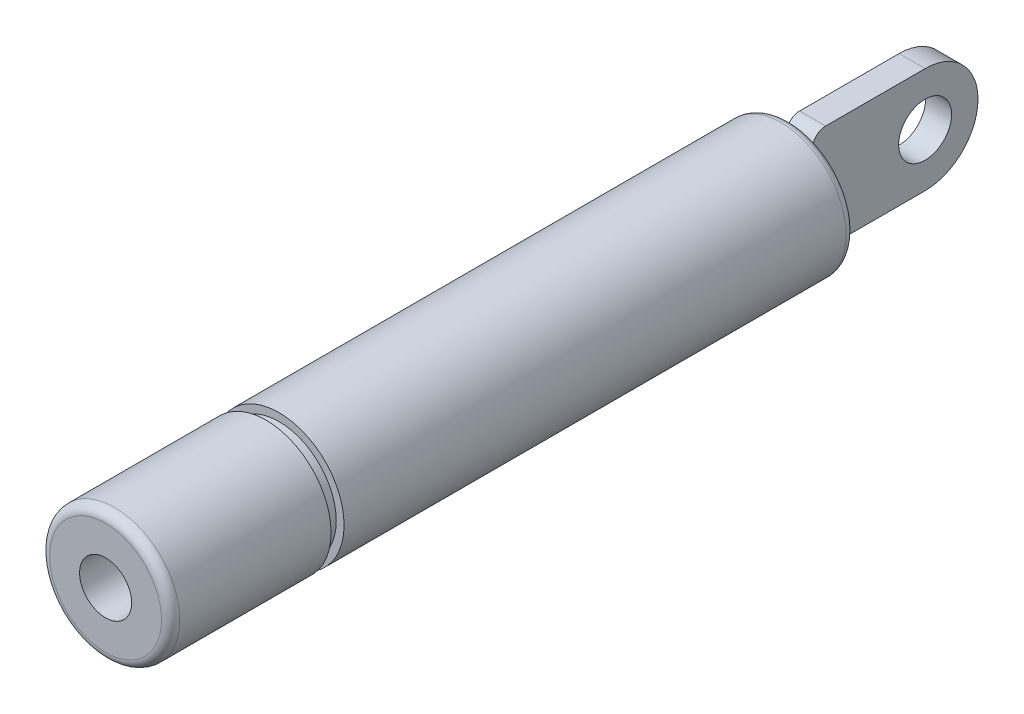
ISO-10303-21;
HEADER;
FILE_DESCRIPTION(('STEP AP214'),'2;1');
FILE_NAME('part.step','',(''),(''),'','','');
FILE_SCHEMA(('AUTOMOTIVE_DESIGN { 1 0 10303 214 1 1 1 1 }'));
ENDSEC;
DATA;
#1=APPLICATION_CONTEXT('core data for automotive mechanical design processes');
#2=APPLICATION_PROTOCOL_DEFINITION('international standard','automotive_design',2000,#1);
#3=PRODUCT_CONTEXT('',#1,'mechanical');
#4=PRODUCT('Part','Part','',(#3));
#5=PRODUCT_RELATED_PRODUCT_CATEGORY('part','',(#4));
#6=PRODUCT_DEFINITION_FORMATION('','',#4);
#7=PRODUCT_DEFINITION_CONTEXT('part definition',#1,'design');
#8=PRODUCT_DEFINITION('design','',#6,#7);
#9=PRODUCT_DEFINITION_SHAPE('','',#8);
#10=(LENGTH_UNIT() NAMED_UNIT(*) SI_UNIT(.MILLI.,.METRE.));
#11=(NAMED_UNIT(*) PLANE_ANGLE_UNIT() SI_UNIT($,.RADIAN.));
#12=(NAMED_UNIT(*) SI_UNIT($,.STERADIAN.) SOLID_ANGLE_UNIT());
#13=UNCERTAINTY_MEASURE_WITH_UNIT(LENGTH_MEASURE(1.E-05),#10,'distance_accuracy_value','');
#14=(GEOMETRIC_REPRESENTATION_CONTEXT(3) GLOBAL_UNCERTAINTY_ASSIGNED_CONTEXT((#13)) GLOBAL_UNIT_ASSIGNED_CONTEXT((#10,
#11,#12)) REPRESENTATION_CONTEXT('',''));
#15=CARTESIAN_POINT('',(0.,0.,0.));
#16=DIRECTION('',(0.,0.,1.));
#17=DIRECTION('',(1.,0.,0.));
#18=AXIS2_PLACEMENT_3D('',#15,#16,#17);
#19=CARTESIAN_POINT('',(0.,0.,-80.));
#20=DIRECTION('',(0.,0.,1.));
#21=DIRECTION('',(0.,-1.,0.));
#22=AXIS2_PLACEMENT_3D('',#19,#20,#21);
#23=SPHERICAL_SURFACE('',#22,3.);
#24=CARTESIAN_POINT('',(-1.5,0.,-80.));
#25=DIRECTION('',(1.,0.,0.));
#26=DIRECTION('',(0.,0.,-1.));
#27=AXIS2_PLACEMENT_3D('',#24,#25,#26);
#28=CIRCLE('',#27,2.59807621135332);
#29=CARTESIAN_POINT('',(-1.5,-2.59807621135332,-80.));
#30=VERTEX_POINT('',#29);
#31=CARTESIAN_POINT('',(-1.5,2.59807621135332,-80.));
#32=VERTEX_POINT('',#31);
#33=EDGE_CURVE('E179',#30,#32,#28,.T.);
#34=ORIENTED_EDGE('',*,*,#33,.F.);
#35=CARTESIAN_POINT('',(0.,0.,-80.));
#36=DIRECTION('',(0.,0.,1.));
#37=DIRECTION('',(1.,0.,0.));
#38=AXIS2_PLACEMENT_3D('',#35,#36,#37);
#39=CIRCLE('',#38,3.);
#40=EDGE_CURVE('E11',#32,#30,#39,.T.);
#41=ORIENTED_EDGE('',*,*,#40,.F.);
#42=EDGE_LOOP('',(#34,#41));
#43=FACE_BOUND('',#42,.T.);
#44=ADVANCED_FACE('F16',(#43),#23,.T.);
#45=CARTESIAN_POINT('',(0.,3.9,-80.));
#46=DIRECTION('',(0.,0.,-1.));
#47=DIRECTION('',(-1.,0.,0.));
#48=AXIS2_PLACEMENT_3D('',#45,#46,#47);
#49=PLANE('',#48);
#50=CARTESIAN_POINT('',(0.,0.,-80.));
#51=DIRECTION('',(0.,0.,1.));
#52=DIRECTION('',(1.,0.,0.));
#53=AXIS2_PLACEMENT_3D('',#50,#51,#52);
#54=CIRCLE('',#53,3.9);
#55=CARTESIAN_POINT('',(-1.5,3.6,-80.));
#56=VERTEX_POINT('',#55);
#57=CARTESIAN_POINT('',(-1.5,-3.60000000000022,-80.));
#58=VERTEX_POINT('',#57);
#59=EDGE_CURVE('E254',#56,#58,#54,.T.);
#60=ORIENTED_EDGE('',*,*,#59,.F.);
#61=DIRECTION('',(0.,1.,0.));
#62=VECTOR('',#61,1.);
#63=CARTESIAN_POINT('',(-1.5,-4.575,-80.));
#64=LINE('',#63,#62);
#65=EDGE_CURVE('E131',#32,#56,#64,.T.);
#66=ORIENTED_EDGE('',*,*,#65,.F.);
#67=ORIENTED_EDGE('',*,*,#40,.T.);
#68=EDGE_CURVE('E121',#58,#30,#64,.T.);
#69=ORIENTED_EDGE('',*,*,#68,.F.);
#70=EDGE_LOOP('',(#60,#66,#67,#69));
#71=FACE_BOUND('',#70,.T.);
#72=ADVANCED_FACE('F298',(#71),#49,.T.);
#73=CARTESIAN_POINT('',(0.,0.,-65.5));
#74=DIRECTION('',(0.,0.,-1.));
#75=DIRECTION('',(-1.,0.,0.));
#76=AXIS2_PLACEMENT_3D('',#73,#74,#75);
#77=PLANE('',#76);
#78=CARTESIAN_POINT('',(0.,0.,-65.5));
#79=DIRECTION('',(0.,0.,1.));
#80=DIRECTION('',(0.,-1.,0.));
#81=AXIS2_PLACEMENT_3D('',#78,#79,#80);
#82=CIRCLE('',#81,6.);
#83=CARTESIAN_POINT('',(0.,-6.,-65.5));
#84=VERTEX_POINT('',#83);
#85=EDGE_CURVE('E208',#84,#84,#82,.T.);
#86=ORIENTED_EDGE('',*,*,#85,.T.);
#87=EDGE_LOOP('',(#86));
#88=FACE_BOUND('',#87,.T.);
#89=ADVANCED_FACE('F303',(#88),#77,.F.);
#90=CARTESIAN_POINT('',(0.,0.,-21.5));
#91=DIRECTION('',(0.,0.,1.));
#92=DIRECTION('',(1.,0.,0.));
#93=AXIS2_PLACEMENT_3D('',#90,#91,#92);
#94=PLANE('',#93);
#95=CARTESIAN_POINT('',(0.,0.,-21.5));
#96=DIRECTION('',(0.,0.,1.));
#97=DIRECTION('',(1.,0.,0.));
#98=AXIS2_PLACEMENT_3D('',#95,#96,#97);
#99=CIRCLE('',#98,3.);
#100=CARTESIAN_POINT('',(3.,0.,-21.5));
#101=VERTEX_POINT('',#100);
#102=EDGE_CURVE('E20',#101,#101,#99,.T.);
#103=ORIENTED_EDGE('',*,*,#102,.T.);
#104=EDGE_LOOP('',(#103));
#105=FACE_BOUND('',#104,.T.);
#106=CARTESIAN_POINT('',(0.,0.,-21.5));
#107=DIRECTION('',(0.,0.,-1.));
#108=DIRECTION('',(0.,-1.,0.));
#109=AXIS2_PLACEMENT_3D('',#106,#107,#108);
#110=CIRCLE('',#109,6.);
#111=CARTESIAN_POINT('',(0.,-6.,-21.5));
#112=VERTEX_POINT('',#111);
#113=EDGE_CURVE('E204',#112,#112,#110,.T.);
#114=ORIENTED_EDGE('',*,*,#113,.T.);
#115=EDGE_LOOP('',(#114));
#116=FACE_BOUND('',#115,.T.);
#117=ADVANCED_FACE('F319',(#105,#116),#94,.F.);
#118=CARTESIAN_POINT('',(0.,0.,-21.5));
#119=DIRECTION('',(0.,0.,-1.));
#120=DIRECTION('',(0.,-1.,0.));
#121=AXIS2_PLACEMENT_3D('',#118,#119,#120);
#122=CYLINDRICAL_SURFACE('',#121,6.);
#123=ORIENTED_EDGE('',*,*,#85,.F.);
#124=EDGE_LOOP('',(#123));
#125=FACE_BOUND('',#124,.T.);
#126=ORIENTED_EDGE('',*,*,#113,.F.);
#127=EDGE_LOOP('',(#126));
#128=FACE_BOUND('',#127,.T.);
#129=ADVANCED_FACE('F313',(#125,#128),#122,.F.);
#130=CARTESIAN_POINT('',(0.,0.,1.));
#131=DIRECTION('',(0.,0.,-1.));
#132=DIRECTION('',(0.,-1.,0.));
#133=AXIS2_PLACEMENT_3D('',#130,#131,#132);
#134=CYLINDRICAL_SURFACE('',#133,3.);
#135=CARTESIAN_POINT('',(0.,0.,0.));
#136=DIRECTION('',(0.,0.,1.));
#137=DIRECTION('',(1.,0.,0.));
#138=AXIS2_PLACEMENT_3D('',#135,#136,#137);
#139=CIRCLE('',#138,3.);
#140=CARTESIAN_POINT('',(3.,0.,0.));
#141=VERTEX_POINT('',#140);
#142=EDGE_CURVE('E200',#141,#141,#139,.T.);
#143=ORIENTED_EDGE('',*,*,#142,.T.);
#144=EDGE_LOOP('',(#143));
#145=FACE_BOUND('',#144,.T.);
#146=ORIENTED_EDGE('',*,*,#102,.F.);
#147=EDGE_LOOP('',(#146));
#148=FACE_BOUND('',#147,.T.);
#149=ADVANCED_FACE('F307',(#145,#148),#134,.F.);
#150=CARTESIAN_POINT('',(1.5,-2.59807621135332,-80.));
#151=VERTEX_POINT('',#150);
#152=CARTESIAN_POINT('',(1.5,2.59807621135332,-80.));
#153=VERTEX_POINT('',#152);
#154=EDGE_CURVE('E26',#151,#153,#39,.T.);
#155=ORIENTED_EDGE('',*,*,#154,.F.);
#156=CARTESIAN_POINT('',(1.5,0.,-80.));
#157=DIRECTION('',(1.,0.,0.));
#158=DIRECTION('',(0.,0.,-1.));
#159=AXIS2_PLACEMENT_3D('',#156,#157,#158);
#160=CIRCLE('',#159,2.59807621135332);
#161=EDGE_CURVE('E196',#151,#153,#160,.T.);
#162=ORIENTED_EDGE('',*,*,#161,.T.);
#163=EDGE_LOOP('',(#155,#162));
#164=FACE_BOUND('',#163,.T.);
#165=ADVANCED_FACE('F18',(#164),#23,.T.);
#166=DIRECTION('',(0.,1.,0.));
#167=VECTOR('',#166,1.);
#168=CARTESIAN_POINT('',(1.5,-4.575,-80.));
#169=LINE('',#168,#167);
#170=CARTESIAN_POINT('',(1.5,3.6,-80.));
#171=VERTEX_POINT('',#170);
#172=EDGE_CURVE('E265',#153,#171,#169,.T.);
#173=ORIENTED_EDGE('',*,*,#172,.T.);
#174=CARTESIAN_POINT('',(1.5,-3.6,-80.));
#175=VERTEX_POINT('',#174);
#176=EDGE_CURVE('E252',#175,#171,#54,.T.);
#177=ORIENTED_EDGE('',*,*,#176,.F.);
#178=EDGE_CURVE('E161',#175,#151,#169,.T.);
#179=ORIENTED_EDGE('',*,*,#178,.T.);
#180=ORIENTED_EDGE('',*,*,#154,.T.);
#181=EDGE_LOOP('',(#173,#177,#179,#180));
#182=FACE_BOUND('',#181,.T.);
#183=ADVANCED_FACE('F263',(#182),#49,.T.);
#184=CARTESIAN_POINT('',(0.,0.,-79.1));
#185=DIRECTION('',(0.,0.,1.));
#186=DIRECTION('',(1.,0.,0.));
#187=AXIS2_PLACEMENT_3D('',#184,#185,#186);
#188=TOROIDAL_SURFACE('',#187,3.9,0.9);
#189=CARTESIAN_POINT('',(0.,0.,-79.1));
#190=DIRECTION('',(0.,0.,1.));
#191=DIRECTION('',(1.,0.,0.));
#192=AXIS2_PLACEMENT_3D('',#189,#190,#191);
#193=CIRCLE('',#192,4.8);
#194=CARTESIAN_POINT('',(4.80000000000001,0.,-79.1));
#195=VERTEX_POINT('',#194);
#196=EDGE_CURVE('E248',#195,#195,#193,.T.);
#197=ORIENTED_EDGE('',*,*,#196,.F.);
#198=EDGE_LOOP('',(#197));
#199=FACE_BOUND('',#198,.T.);
#200=EDGE_CURVE('E41',#171,#56,#54,.T.);
#201=ORIENTED_EDGE('',*,*,#200,.T.);
#202=ORIENTED_EDGE('',*,*,#59,.T.);
#203=EDGE_CURVE('E119',#58,#175,#54,.T.);
#204=ORIENTED_EDGE('',*,*,#203,.T.);
#205=ORIENTED_EDGE('',*,*,#176,.T.);
#206=EDGE_LOOP('',(#201,#202,#204,#205));
#207=FACE_BOUND('',#206,.T.);
#208=ADVANCED_FACE('F312',(#199,#207),#188,.T.);
#209=CARTESIAN_POINT('',(0.,0.,0.));
#210=DIRECTION('',(0.,0.,1.));
#211=DIRECTION('',(1.,0.,0.));
#212=AXIS2_PLACEMENT_3D('',#209,#210,#211);
#213=CYLINDRICAL_SURFACE('',#212,4.8);
#214=ORIENTED_EDGE('',*,*,#196,.T.);
#215=EDGE_LOOP('',(#214));
#216=FACE_BOUND('',#215,.T.);
#217=CARTESIAN_POINT('',(0.,0.,-78.95));
#218=DIRECTION('',(0.,0.,1.));
#219=DIRECTION('',(1.,0.,0.));
#220=AXIS2_PLACEMENT_3D('',#217,#218,#219);
#221=CIRCLE('',#220,4.8);
#222=CARTESIAN_POINT('',(4.80000000000001,0.,-78.95));
#223=VERTEX_POINT('',#222);
#224=EDGE_CURVE('E244',#223,#223,#221,.T.);
#225=ORIENTED_EDGE('',*,*,#224,.F.);
#226=EDGE_LOOP('',(#225));
#227=FACE_BOUND('',#226,.T.);
#228=ADVANCED_FACE('F367',(#216,#227),#213,.T.);
#229=CARTESIAN_POINT('',(0.,6.45,-78.95));
#230=DIRECTION('',(0.,0.,-1.));
#231=DIRECTION('',(-1.,0.,0.));
#232=AXIS2_PLACEMENT_3D('',#229,#230,#231);
#233=PLANE('',#232);
#234=ORIENTED_EDGE('',*,*,#224,.T.);
#235=EDGE_LOOP('',(#234));
#236=FACE_BOUND('',#235,.T.);
#237=CARTESIAN_POINT('',(0.,0.,-78.95));
#238=DIRECTION('',(0.,0.,1.));
#239=DIRECTION('',(1.,0.,0.));
#240=AXIS2_PLACEMENT_3D('',#237,#238,#239);
#241=CIRCLE('',#240,6.45);
#242=CARTESIAN_POINT('',(6.45000000000001,0.,-78.95));
#243=VERTEX_POINT('',#242);
#244=EDGE_CURVE('E240',#243,#243,#241,.T.);
#245=ORIENTED_EDGE('',*,*,#244,.F.);
#246=EDGE_LOOP('',(#245));
#247=FACE_BOUND('',#246,.T.);
#248=ADVANCED_FACE('F363',(#236,#247),#233,.T.);
#249=CARTESIAN_POINT('',(0.,0.,-77.9));
#250=DIRECTION('',(0.,0.,1.));
#251=DIRECTION('',(1.,0.,0.));
#252=AXIS2_PLACEMENT_3D('',#249,#250,#251);
#253=TOROIDAL_SURFACE('',#252,6.45,1.05);
#254=CARTESIAN_POINT('',(0.,0.,-77.9));
#255=DIRECTION('',(0.,0.,1.));
#256=DIRECTION('',(1.,0.,0.));
#257=AXIS2_PLACEMENT_3D('',#254,#255,#256);
#258=CIRCLE('',#257,7.5);
#259=CARTESIAN_POINT('',(7.5,0.,-77.9));
#260=VERTEX_POINT('',#259);
#261=EDGE_CURVE('E236',#260,#260,#258,.T.);
#262=ORIENTED_EDGE('',*,*,#261,.F.);
#263=EDGE_LOOP('',(#262));
#264=FACE_BOUND('',#263,.T.);
#265=ORIENTED_EDGE('',*,*,#244,.T.);
#266=EDGE_LOOP('',(#265));
#267=FACE_BOUND('',#266,.T.);
#268=ADVANCED_FACE('F359',(#264,#267),#253,.T.);
#269=CARTESIAN_POINT('',(0.,0.,0.));
#270=DIRECTION('',(0.,0.,1.));
#271=DIRECTION('',(1.,0.,0.));
#272=AXIS2_PLACEMENT_3D('',#269,#270,#271);
#273=CYLINDRICAL_SURFACE('',#272,7.5);
#274=ORIENTED_EDGE('',*,*,#261,.T.);
#275=EDGE_LOOP('',(#274));
#276=FACE_BOUND('',#275,.T.);
#277=CARTESIAN_POINT('',(0.,0.,-20.));
#278=DIRECTION('',(0.,0.,1.));
#279=DIRECTION('',(1.,0.,0.));
#280=AXIS2_PLACEMENT_3D('',#277,#278,#279);
#281=CIRCLE('',#280,7.5);
#282=CARTESIAN_POINT('',(7.5,0.,-20.));
#283=VERTEX_POINT('',#282);
#284=EDGE_CURVE('E232',#283,#283,#281,.T.);
#285=ORIENTED_EDGE('',*,*,#284,.F.);
#286=EDGE_LOOP('',(#285));
#287=FACE_BOUND('',#286,.T.);
#288=ADVANCED_FACE('F355',(#276,#287),#273,.T.);
#289=CARTESIAN_POINT('',(0.,6.6,-20.));
#290=DIRECTION('',(0.,0.,1.));
#291=DIRECTION('',(1.,0.,0.));
#292=AXIS2_PLACEMENT_3D('',#289,#290,#291);
#293=PLANE('',#292);
#294=ORIENTED_EDGE('',*,*,#284,.T.);
#295=EDGE_LOOP('',(#294));
#296=FACE_BOUND('',#295,.T.);
#297=CARTESIAN_POINT('',(0.,0.,-20.));
#298=DIRECTION('',(0.,0.,1.));
#299=DIRECTION('',(1.,0.,0.));
#300=AXIS2_PLACEMENT_3D('',#297,#298,#299);
#301=CIRCLE('',#300,6.6);
#302=CARTESIAN_POINT('',(6.6,0.,-20.));
#303=VERTEX_POINT('',#302);
#304=EDGE_CURVE('E228',#303,#303,#301,.T.);
#305=ORIENTED_EDGE('',*,*,#304,.F.);
#306=EDGE_LOOP('',(#305));
#307=FACE_BOUND('',#306,.T.);
#308=ADVANCED_FACE('F351',(#296,#307),#293,.T.);
#309=CARTESIAN_POINT('',(0.,0.,0.));
#310=DIRECTION('',(0.,0.,1.));
#311=DIRECTION('',(1.,0.,0.));
#312=AXIS2_PLACEMENT_3D('',#309,#310,#311);
#313=CYLINDRICAL_SURFACE('',#312,6.6);
#314=ORIENTED_EDGE('',*,*,#304,.T.);
#315=EDGE_LOOP('',(#314));
#316=FACE_BOUND('',#315,.T.);
#317=CARTESIAN_POINT('',(0.,0.,-18.5));
#318=DIRECTION('',(0.,0.,1.));
#319=DIRECTION('',(1.,0.,0.));
#320=AXIS2_PLACEMENT_3D('',#317,#318,#319);
#321=CIRCLE('',#320,6.6);
#322=CARTESIAN_POINT('',(6.6,0.,-18.5));
#323=VERTEX_POINT('',#322);
#324=EDGE_CURVE('E224',#323,#323,#321,.T.);
#325=ORIENTED_EDGE('',*,*,#324,.F.);
#326=EDGE_LOOP('',(#325));
#327=FACE_BOUND('',#326,.T.);
#328=ADVANCED_FACE('F347',(#316,#327),#313,.T.);
#329=CARTESIAN_POINT('',(0.,7.5,-18.5));
#330=DIRECTION('',(0.,0.,-1.));
#331=DIRECTION('',(-1.,0.,0.));
#332=AXIS2_PLACEMENT_3D('',#329,#330,#331);
#333=PLANE('',#332);
#334=ORIENTED_EDGE('',*,*,#324,.T.);
#335=EDGE_LOOP('',(#334));
#336=FACE_BOUND('',#335,.T.);
#337=CARTESIAN_POINT('',(0.,0.,-18.5));
#338=DIRECTION('',(0.,0.,1.));
#339=DIRECTION('',(1.,0.,0.));
#340=AXIS2_PLACEMENT_3D('',#337,#338,#339);
#341=CIRCLE('',#340,7.5);
#342=CARTESIAN_POINT('',(7.5,0.,-18.5));
#343=VERTEX_POINT('',#342);
#344=EDGE_CURVE('E220',#343,#343,#341,.T.);
#345=ORIENTED_EDGE('',*,*,#344,.F.);
#346=EDGE_LOOP('',(#345));
#347=FACE_BOUND('',#346,.T.);
#348=ADVANCED_FACE('F343',(#336,#347),#333,.T.);
#349=CARTESIAN_POINT('',(0.,0.,0.));
#350=DIRECTION('',(0.,0.,1.));
#351=DIRECTION('',(1.,0.,0.));
#352=AXIS2_PLACEMENT_3D('',#349,#350,#351);
#353=CYLINDRICAL_SURFACE('',#352,7.5);
#354=ORIENTED_EDGE('',*,*,#344,.T.);
#355=EDGE_LOOP('',(#354));
#356=FACE_BOUND('',#355,.T.);
#357=CARTESIAN_POINT('',(0.,0.,-1.05));
#358=DIRECTION('',(0.,0.,1.));
#359=DIRECTION('',(1.,0.,0.));
#360=AXIS2_PLACEMENT_3D('',#357,#358,#359);
#361=CIRCLE('',#360,7.5);
#362=CARTESIAN_POINT('',(7.5,0.,-1.05));
#363=VERTEX_POINT('',#362);
#364=EDGE_CURVE('E216',#363,#363,#361,.T.);
#365=ORIENTED_EDGE('',*,*,#364,.F.);
#366=EDGE_LOOP('',(#365));
#367=FACE_BOUND('',#366,.T.);
#368=ADVANCED_FACE('F339',(#356,#367),#353,.T.);
#369=CARTESIAN_POINT('',(0.,0.,-1.05));
#370=DIRECTION('',(0.,0.,1.));
#371=DIRECTION('',(1.,0.,0.));
#372=AXIS2_PLACEMENT_3D('',#369,#370,#371);
#373=TOROIDAL_SURFACE('',#372,6.45,1.05);
#374=CARTESIAN_POINT('',(0.,0.,0.));
#375=DIRECTION('',(0.,0.,1.));
#376=DIRECTION('',(1.,0.,0.));
#377=AXIS2_PLACEMENT_3D('',#374,#375,#376);
#378=CIRCLE('',#377,6.45);
#379=CARTESIAN_POINT('',(6.45,0.,0.));
#380=VERTEX_POINT('',#379);
#381=EDGE_CURVE('E212',#380,#380,#378,.T.);
#382=ORIENTED_EDGE('',*,*,#381,.F.);
#383=EDGE_LOOP('',(#382));
#384=FACE_BOUND('',#383,.T.);
#385=ORIENTED_EDGE('',*,*,#364,.T.);
#386=EDGE_LOOP('',(#385));
#387=FACE_BOUND('',#386,.T.);
#388=ADVANCED_FACE('F335',(#384,#387),#373,.T.);
#389=CARTESIAN_POINT('',(0.,0.,0.));
#390=DIRECTION('',(0.,0.,1.));
#391=DIRECTION('',(1.,0.,0.));
#392=AXIS2_PLACEMENT_3D('',#389,#390,#391);
#393=PLANE('',#392);
#394=ORIENTED_EDGE('',*,*,#142,.F.);
#395=EDGE_LOOP('',(#394));
#396=FACE_BOUND('',#395,.T.);
#397=ORIENTED_EDGE('',*,*,#381,.T.);
#398=EDGE_LOOP('',(#397));
#399=FACE_BOUND('',#398,.T.);
#400=ADVANCED_FACE('F332',(#396,#399),#393,.T.);
#401=CARTESIAN_POINT('',(1.5,-4.575,-80.));
#402=DIRECTION('',(0.,0.,1.));
#403=DIRECTION('',(0.,-1.,0.));
#404=AXIS2_PLACEMENT_3D('',#401,#402,#403);
#405=PLANE('',#404);
#406=ORIENTED_EDGE('',*,*,#200,.F.);
#407=CARTESIAN_POINT('',(1.5,4.575,-80.));
#408=VERTEX_POINT('',#407);
#409=EDGE_CURVE('E162',#171,#408,#169,.T.);
#410=ORIENTED_EDGE('',*,*,#409,.T.);
#411=DIRECTION('',(-1.,0.,0.));
#412=VECTOR('',#411,1.);
#413=CARTESIAN_POINT('',(1.5,4.575,-80.));
#414=LINE('',#413,#412);
#415=CARTESIAN_POINT('',(-1.5,4.575,-80.));
#416=VERTEX_POINT('',#415);
#417=EDGE_CURVE('E104',#408,#416,#414,.T.);
#418=ORIENTED_EDGE('',*,*,#417,.T.);
#419=EDGE_CURVE('E123',#56,#416,#64,.T.);
#420=ORIENTED_EDGE('',*,*,#419,.F.);
#421=EDGE_LOOP('',(#406,#410,#418,#420));
#422=FACE_BOUND('',#421,.T.);
#423=ADVANCED_FACE('F278',(#422),#405,.T.);
#424=ORIENTED_EDGE('',*,*,#203,.F.);
#425=CARTESIAN_POINT('',(-1.5,-4.575,-80.));
#426=VERTEX_POINT('',#425);
#427=EDGE_CURVE('E109',#426,#58,#64,.T.);
#428=ORIENTED_EDGE('',*,*,#427,.F.);
#429=DIRECTION('',(-1.,0.,0.));
#430=VECTOR('',#429,1.);
#431=CARTESIAN_POINT('',(1.5,-4.575,-80.));
#432=LINE('',#431,#430);
#433=CARTESIAN_POINT('',(1.5,-4.575,-80.));
#434=VERTEX_POINT('',#433);
#435=EDGE_CURVE('E95',#434,#426,#432,.T.);
#436=ORIENTED_EDGE('',*,*,#435,.F.);
#437=EDGE_CURVE('E33',#434,#175,#169,.T.);
#438=ORIENTED_EDGE('',*,*,#437,.T.);
#439=EDGE_LOOP('',(#424,#428,#436,#438));
#440=FACE_BOUND('',#439,.T.);
#441=ADVANCED_FACE('F117',(#440),#405,.T.);
#442=CARTESIAN_POINT('',(1.5,-4.575,-81.525));
#443=DIRECTION('',(1.,0.,0.));
#444=DIRECTION('',(0.,0.,-1.));
#445=AXIS2_PLACEMENT_3D('',#442,#443,#444);
#446=PLANE('',#445);
#447=CARTESIAN_POINT('',(1.5,0.,-93.));
#448=DIRECTION('',(1.,0.,0.));
#449=DIRECTION('',(0.,0.,-1.));
#450=AXIS2_PLACEMENT_3D('',#447,#448,#449);
#451=CIRCLE('',#450,3.05);
#452=CARTESIAN_POINT('',(1.5,0.,-96.05));
#453=VERTEX_POINT('',#452);
#454=EDGE_CURVE('E115',#453,#453,#451,.T.);
#455=ORIENTED_EDGE('',*,*,#454,.F.);
#456=EDGE_LOOP('',(#455));
#457=FACE_BOUND('',#456,.T.);
#458=ORIENTED_EDGE('',*,*,#161,.F.);
#459=ORIENTED_EDGE('',*,*,#178,.F.);
#460=ORIENTED_EDGE('',*,*,#437,.F.);
#461=CARTESIAN_POINT('',(1.5,-4.575,-81.525));
#462=DIRECTION('',(1.,0.,0.));
#463=DIRECTION('',(0.,0.,-1.));
#464=AXIS2_PLACEMENT_3D('',#461,#462,#463);
#465=CIRCLE('',#464,1.525);
#466=CARTESIAN_POINT('',(1.5,-6.1,-81.525));
#467=VERTEX_POINT('',#466);
#468=EDGE_CURVE('E101',#434,#467,#465,.T.);
#469=ORIENTED_EDGE('',*,*,#468,.T.);
#470=DIRECTION('',(0.,0.,-1.));
#471=VECTOR('',#470,1.);
#472=CARTESIAN_POINT('',(1.5,-6.1,-81.525));
#473=LINE('',#472,#471);
#474=CARTESIAN_POINT('',(1.5,-6.1,-93.));
#475=VERTEX_POINT('',#474);
#476=EDGE_CURVE('E128',#467,#475,#473,.T.);
#477=ORIENTED_EDGE('',*,*,#476,.T.);
#478=CARTESIAN_POINT('',(1.5,0.,-93.));
#479=DIRECTION('',(1.,0.,0.));
#480=DIRECTION('',(0.,0.,-1.));
#481=AXIS2_PLACEMENT_3D('',#478,#479,#480);
#482=CIRCLE('',#481,6.1);
#483=CARTESIAN_POINT('',(1.5,6.1,-93.));
#484=VERTEX_POINT('',#483);
#485=EDGE_CURVE('E171',#475,#484,#482,.T.);
#486=ORIENTED_EDGE('',*,*,#485,.T.);
#487=DIRECTION('',(0.,0.,-1.));
#488=VECTOR('',#487,1.);
#489=CARTESIAN_POINT('',(1.5,6.1,-81.525));
#490=LINE('',#489,#488);
#491=CARTESIAN_POINT('',(1.5,6.1,-81.525));
#492=VERTEX_POINT('',#491);
#493=EDGE_CURVE('E167',#492,#484,#490,.T.);
#494=ORIENTED_EDGE('',*,*,#493,.F.);
#495=CARTESIAN_POINT('',(1.5,4.575,-81.525));
#496=DIRECTION('',(1.,0.,0.));
#497=DIRECTION('',(0.,0.,-1.));
#498=AXIS2_PLACEMENT_3D('',#495,#496,#497);
#499=CIRCLE('',#498,1.525);
#500=EDGE_CURVE('E163',#492,#408,#499,.T.);
#501=ORIENTED_EDGE('',*,*,#500,.T.);
#502=ORIENTED_EDGE('',*,*,#409,.F.);
#503=ORIENTED_EDGE('',*,*,#172,.F.);
#504=EDGE_LOOP('',(#458,#459,#460,#469,#477,#486,#494,#501,#502,#503));
#505=FACE_BOUND('',#504,.T.);
#506=ADVANCED_FACE('F269',(#457,#505),#446,.T.);
#507=CARTESIAN_POINT('',(-1.5,-4.575,-81.525));
#508=DIRECTION('',(1.,0.,0.));
#509=DIRECTION('',(0.,0.,-1.));
#510=AXIS2_PLACEMENT_3D('',#507,#508,#509);
#511=PLANE('',#510);
#512=CARTESIAN_POINT('',(-1.5,0.,-93.));
#513=DIRECTION('',(1.,0.,0.));
#514=DIRECTION('',(0.,0.,-1.));
#515=AXIS2_PLACEMENT_3D('',#512,#513,#514);
#516=CIRCLE('',#515,3.05);
#517=CARTESIAN_POINT('',(-1.5,0.,-96.05));
#518=VERTEX_POINT('',#517);
#519=EDGE_CURVE('E191',#518,#518,#516,.T.);
#520=ORIENTED_EDGE('',*,*,#519,.T.);
#521=EDGE_LOOP('',(#520));
#522=FACE_BOUND('',#521,.T.);
#523=ORIENTED_EDGE('',*,*,#68,.T.);
#524=ORIENTED_EDGE('',*,*,#33,.T.);
#525=ORIENTED_EDGE('',*,*,#65,.T.);
#526=ORIENTED_EDGE('',*,*,#419,.T.);
#527=CARTESIAN_POINT('',(-1.5,4.575,-81.525));
#528=DIRECTION('',(1.,0.,0.));
#529=DIRECTION('',(0.,0.,-1.));
#530=AXIS2_PLACEMENT_3D('',#527,#528,#529);
#531=CIRCLE('',#530,1.525);
#532=CARTESIAN_POINT('',(-1.5,6.1,-81.525));
#533=VERTEX_POINT('',#532);
#534=EDGE_CURVE('E135',#533,#416,#531,.T.);
#535=ORIENTED_EDGE('',*,*,#534,.F.);
#536=DIRECTION('',(0.,0.,-1.));
#537=VECTOR('',#536,1.);
#538=CARTESIAN_POINT('',(-1.5,6.1,-81.525));
#539=LINE('',#538,#537);
#540=CARTESIAN_POINT('',(-1.5,6.1,-93.));
#541=VERTEX_POINT('',#540);
#542=EDGE_CURVE('E144',#533,#541,#539,.T.);
#543=ORIENTED_EDGE('',*,*,#542,.T.);
#544=CARTESIAN_POINT('',(-1.5,0.,-93.));
#545=DIRECTION('',(1.,0.,0.));
#546=DIRECTION('',(0.,0.,-1.));
#547=AXIS2_PLACEMENT_3D('',#544,#545,#546);
#548=CIRCLE('',#547,6.1);
#549=CARTESIAN_POINT('',(-1.5,-6.1,-93.));
#550=VERTEX_POINT('',#549);
#551=EDGE_CURVE('E151',#550,#541,#548,.T.);
#552=ORIENTED_EDGE('',*,*,#551,.F.);
#553=DIRECTION('',(0.,0.,-1.));
#554=VECTOR('',#553,1.);
#555=CARTESIAN_POINT('',(-1.5,-6.1,-81.525));
#556=LINE('',#555,#554);
#557=CARTESIAN_POINT('',(-1.5,-6.1,-81.525));
#558=VERTEX_POINT('',#557);
#559=EDGE_CURVE('E112',#558,#550,#556,.T.);
#560=ORIENTED_EDGE('',*,*,#559,.F.);
#561=CARTESIAN_POINT('',(-1.5,-4.575,-81.525));
#562=DIRECTION('',(1.,0.,0.));
#563=DIRECTION('',(0.,0.,-1.));
#564=AXIS2_PLACEMENT_3D('',#561,#562,#563);
#565=CIRCLE('',#564,1.525);
#566=EDGE_CURVE('E99',#426,#558,#565,.T.);
#567=ORIENTED_EDGE('',*,*,#566,.F.);
#568=ORIENTED_EDGE('',*,*,#427,.T.);
#569=EDGE_LOOP('',(#523,#524,#525,#526,#535,#543,#552,#560,#567,#568));
#570=FACE_BOUND('',#569,.T.);
#571=ADVANCED_FACE('F108',(#522,#570),#511,.F.);
#572=CARTESIAN_POINT('',(1.5,-4.575,-81.525));
#573=DIRECTION('',(-1.,0.,0.));
#574=DIRECTION('',(0.,0.,1.));
#575=AXIS2_PLACEMENT_3D('',#572,#573,#574);
#576=CYLINDRICAL_SURFACE('',#575,1.525);
#577=ORIENTED_EDGE('',*,*,#566,.T.);
#578=DIRECTION('',(-1.,0.,0.));
#579=VECTOR('',#578,1.);
#580=CARTESIAN_POINT('',(1.5,-6.1,-81.525));
#581=LINE('',#580,#579);
#582=EDGE_CURVE('E176',#467,#558,#581,.T.);
#583=ORIENTED_EDGE('',*,*,#582,.F.);
#584=ORIENTED_EDGE('',*,*,#468,.F.);
#585=ORIENTED_EDGE('',*,*,#435,.T.);
#586=EDGE_LOOP('',(#577,#583,#584,#585));
#587=FACE_BOUND('',#586,.T.);
#588=ADVANCED_FACE('F97',(#587),#576,.T.);
#589=CARTESIAN_POINT('',(1.5,-6.1,-81.525));
#590=DIRECTION('',(0.,1.,0.));
#591=DIRECTION('',(0.,0.,1.));
#592=AXIS2_PLACEMENT_3D('',#589,#590,#591);
#593=PLANE('',#592);
#594=ORIENTED_EDGE('',*,*,#559,.T.);
#595=DIRECTION('',(-1.,0.,0.));
#596=VECTOR('',#595,1.);
#597=CARTESIAN_POINT('',(1.5,-6.1,-93.));
#598=LINE('',#597,#596);
#599=EDGE_CURVE('E180',#475,#550,#598,.T.);
#600=ORIENTED_EDGE('',*,*,#599,.F.);
#601=ORIENTED_EDGE('',*,*,#476,.F.);
#602=ORIENTED_EDGE('',*,*,#582,.T.);
#603=EDGE_LOOP('',(#594,#600,#601,#602));
#604=FACE_BOUND('',#603,.T.);
#605=ADVANCED_FACE('F554',(#604),#593,.F.);
#606=CARTESIAN_POINT('',(1.5,0.,-93.));
#607=DIRECTION('',(-1.,0.,0.));
#608=DIRECTION('',(0.,0.,1.));
#609=AXIS2_PLACEMENT_3D('',#606,#607,#608);
#610=CYLINDRICAL_SURFACE('',#609,6.1);
#611=ORIENTED_EDGE('',*,*,#551,.T.);
#612=DIRECTION('',(-1.,0.,0.));
#613=VECTOR('',#612,1.);
#614=CARTESIAN_POINT('',(1.5,6.1,-93.));
#615=LINE('',#614,#613);
#616=EDGE_CURVE('E184',#484,#541,#615,.T.);
#617=ORIENTED_EDGE('',*,*,#616,.F.);
#618=ORIENTED_EDGE('',*,*,#485,.F.);
#619=ORIENTED_EDGE('',*,*,#599,.T.);
#620=EDGE_LOOP('',(#611,#617,#618,#619));
#621=FACE_BOUND('',#620,.T.);
#622=ADVANCED_FACE('F293',(#621),#610,.T.);
#623=CARTESIAN_POINT('',(1.5,6.1,-81.525));
#624=DIRECTION('',(0.,1.,0.));
#625=DIRECTION('',(0.,0.,1.));
#626=AXIS2_PLACEMENT_3D('',#623,#624,#625);
#627=PLANE('',#626);
#628=ORIENTED_EDGE('',*,*,#542,.F.);
#629=DIRECTION('',(-1.,0.,0.));
#630=VECTOR('',#629,1.);
#631=CARTESIAN_POINT('',(1.5,6.1,-81.525));
#632=LINE('',#631,#630);
#633=EDGE_CURVE('E187',#492,#533,#632,.T.);
#634=ORIENTED_EDGE('',*,*,#633,.F.);
#635=ORIENTED_EDGE('',*,*,#493,.T.);
#636=ORIENTED_EDGE('',*,*,#616,.T.);
#637=EDGE_LOOP('',(#628,#634,#635,#636));
#638=FACE_BOUND('',#637,.T.);
#639=ADVANCED_FACE('F284',(#638),#627,.T.);
#640=CARTESIAN_POINT('',(1.5,4.575,-81.525));
#641=DIRECTION('',(-1.,0.,0.));
#642=DIRECTION('',(0.,0.,1.));
#643=AXIS2_PLACEMENT_3D('',#640,#641,#642);
#644=CYLINDRICAL_SURFACE('',#643,1.525);
#645=ORIENTED_EDGE('',*,*,#534,.T.);
#646=ORIENTED_EDGE('',*,*,#417,.F.);
#647=ORIENTED_EDGE('',*,*,#500,.F.);
#648=ORIENTED_EDGE('',*,*,#633,.T.);
#649=EDGE_LOOP('',(#645,#646,#647,#648));
#650=FACE_BOUND('',#649,.T.);
#651=ADVANCED_FACE('F281',(#650),#644,.T.);
#652=CARTESIAN_POINT('',(-2.5,0.,-93.));
#653=DIRECTION('',(1.,0.,0.));
#654=DIRECTION('',(0.,1.,0.));
#655=AXIS2_PLACEMENT_3D('',#652,#653,#654);
#656=CYLINDRICAL_SURFACE('',#655,3.05);
#657=ORIENTED_EDGE('',*,*,#454,.T.);
#658=EDGE_LOOP('',(#657));
#659=FACE_BOUND('',#658,.T.);
#660=ORIENTED_EDGE('',*,*,#519,.F.);
#661=EDGE_LOOP('',(#660));
#662=FACE_BOUND('',#661,.T.);
#663=ADVANCED_FACE('F283',(#659,#662),#656,.F.);
#664=CLOSED_SHELL('',(#44,#72,#89,#117,#129,#149,#165,#183,#208,#228,#248,#268,#288,#308,#328,
#348,#368,#388,#400,#423,#441,#506,#571,#588,#605,#622,#639,#651,#663));
#665=MANIFOLD_SOLID_BREP('B1',#664);
#666=ADVANCED_BREP_SHAPE_REPRESENTATION('',(#18,#665),#14);
#667=SHAPE_DEFINITION_REPRESENTATION(#9,#666);
ENDSEC;
END-ISO-10303-21;
